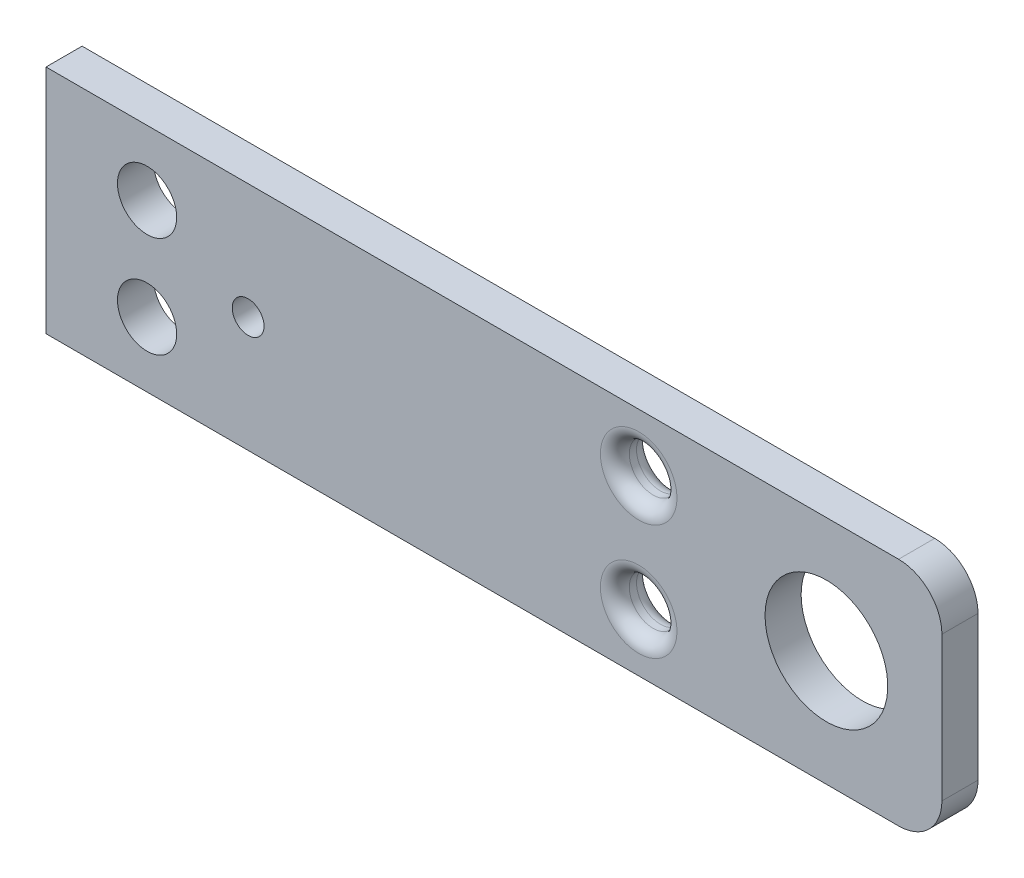
ISO-10303-21;
HEADER;
FILE_DESCRIPTION(('STEP AP214'),'2;1');
FILE_NAME('part.step','',(''),(''),'','','');
FILE_SCHEMA(('AUTOMOTIVE_DESIGN { 1 0 10303 214 1 1 1 1 }'));
ENDSEC;
DATA;
#1=APPLICATION_CONTEXT('core data for automotive mechanical design processes');
#2=APPLICATION_PROTOCOL_DEFINITION('international standard','automotive_design',2000,#1);
#3=PRODUCT_CONTEXT('',#1,'mechanical');
#4=PRODUCT('Part','Part','',(#3));
#5=PRODUCT_RELATED_PRODUCT_CATEGORY('part','',(#4));
#6=PRODUCT_DEFINITION_FORMATION('','',#4);
#7=PRODUCT_DEFINITION_CONTEXT('part definition',#1,'design');
#8=PRODUCT_DEFINITION('design','',#6,#7);
#9=PRODUCT_DEFINITION_SHAPE('','',#8);
#10=(LENGTH_UNIT() NAMED_UNIT(*) SI_UNIT(.MILLI.,.METRE.));
#11=(NAMED_UNIT(*) PLANE_ANGLE_UNIT() SI_UNIT($,.RADIAN.));
#12=(NAMED_UNIT(*) SI_UNIT($,.STERADIAN.) SOLID_ANGLE_UNIT());
#13=UNCERTAINTY_MEASURE_WITH_UNIT(LENGTH_MEASURE(1.E-05),#10,'distance_accuracy_value','');
#14=(GEOMETRIC_REPRESENTATION_CONTEXT(3) GLOBAL_UNCERTAINTY_ASSIGNED_CONTEXT((#13)) GLOBAL_UNIT_ASSIGNED_CONTEXT((#10,
#11,#12)) REPRESENTATION_CONTEXT('',''));
#15=CARTESIAN_POINT('',(0.,0.,0.));
#16=DIRECTION('',(0.,0.,1.));
#17=DIRECTION('',(1.,0.,0.));
#18=AXIS2_PLACEMENT_3D('',#15,#16,#17);
#19=CARTESIAN_POINT('',(-16.4594106635677,-5.06258735987649,0.));
#20=DIRECTION('',(-1.,0.,0.));
#21=DIRECTION('',(0.,0.,1.));
#22=AXIS2_PLACEMENT_3D('',#19,#20,#21);
#23=PLANE('',#22);
#24=DIRECTION('',(0.,1.,0.));
#25=VECTOR('',#24,1.);
#26=CARTESIAN_POINT('',(-16.4594106635677,-5.06258735987649,2.5));
#27=LINE('',#26,#25);
#28=CARTESIAN_POINT('',(-16.4594106635677,-5.06258735987649,2.5));
#29=VERTEX_POINT('',#28);
#30=CARTESIAN_POINT('',(-16.4594106635677,10.9374126401235,2.5));
#31=VERTEX_POINT('',#30);
#32=EDGE_CURVE('E171',#29,#31,#27,.T.);
#33=ORIENTED_EDGE('',*,*,#32,.T.);
#34=DIRECTION('',(0.,0.,1.));
#35=VECTOR('',#34,1.);
#36=CARTESIAN_POINT('',(-16.4594106635677,10.9374126401235,0.));
#37=LINE('',#36,#35);
#38=CARTESIAN_POINT('',(-16.4594106635677,10.9374126401235,0.));
#39=VERTEX_POINT('',#38);
#40=EDGE_CURVE('E109',#39,#31,#37,.T.);
#41=ORIENTED_EDGE('',*,*,#40,.F.);
#42=DIRECTION('',(0.,1.,0.));
#43=VECTOR('',#42,1.);
#44=CARTESIAN_POINT('',(-16.4594106635677,-5.06258735987649,0.));
#45=LINE('',#44,#43);
#46=CARTESIAN_POINT('',(-16.4594106635677,-5.06258735987649,0.));
#47=VERTEX_POINT('',#46);
#48=EDGE_CURVE('E103',#47,#39,#45,.T.);
#49=ORIENTED_EDGE('',*,*,#48,.F.);
#50=DIRECTION('',(0.,0.,1.));
#51=VECTOR('',#50,1.);
#52=CARTESIAN_POINT('',(-16.4594106635677,-5.06258735987649,0.));
#53=LINE('',#52,#51);
#54=EDGE_CURVE('E11',#47,#29,#53,.T.);
#55=ORIENTED_EDGE('',*,*,#54,.T.);
#56=EDGE_LOOP('',(#33,#41,#49,#55));
#57=FACE_BOUND('',#56,.T.);
#58=ADVANCED_FACE('F17',(#57),#23,.T.);
#59=CARTESIAN_POINT('',(42.5905893364316,-5.06258735987649,0.));
#60=DIRECTION('',(0.,-1.,0.));
#61=DIRECTION('',(0.,0.,-1.));
#62=AXIS2_PLACEMENT_3D('',#59,#60,#61);
#63=PLANE('',#62);
#64=DIRECTION('',(-1.,0.,0.));
#65=VECTOR('',#64,1.);
#66=CARTESIAN_POINT('',(42.5905893364316,-5.06258735987649,2.5));
#67=LINE('',#66,#65);
#68=CARTESIAN_POINT('',(42.5905893364316,-5.06258735987649,2.5));
#69=VERTEX_POINT('',#68);
#70=EDGE_CURVE('E94',#69,#29,#67,.T.);
#71=ORIENTED_EDGE('',*,*,#70,.T.);
#72=ORIENTED_EDGE('',*,*,#54,.F.);
#73=DIRECTION('',(-1.,0.,0.));
#74=VECTOR('',#73,1.);
#75=CARTESIAN_POINT('',(42.5905893364316,-5.06258735987649,0.));
#76=LINE('',#75,#74);
#77=CARTESIAN_POINT('',(42.5905893364316,-5.06258735987649,0.));
#78=VERTEX_POINT('',#77);
#79=EDGE_CURVE('E91',#78,#47,#76,.T.);
#80=ORIENTED_EDGE('',*,*,#79,.F.);
#81=DIRECTION('',(0.,0.,1.));
#82=VECTOR('',#81,1.);
#83=CARTESIAN_POINT('',(42.5905893364316,-5.06258735987649,0.));
#84=LINE('',#83,#82);
#85=EDGE_CURVE('E20',#78,#69,#84,.T.);
#86=ORIENTED_EDGE('',*,*,#85,.T.);
#87=EDGE_LOOP('',(#71,#72,#80,#86));
#88=FACE_BOUND('',#87,.T.);
#89=ADVANCED_FACE('F90',(#88),#63,.T.);
#90=CARTESIAN_POINT('',(42.5905893364316,-2.06258735987649,0.));
#91=DIRECTION('',(0.,0.,1.));
#92=DIRECTION('',(0.,1.,0.));
#93=AXIS2_PLACEMENT_3D('',#90,#91,#92);
#94=CYLINDRICAL_SURFACE('',#93,3.);
#95=CARTESIAN_POINT('',(42.5905893364316,-2.06258735987649,2.5));
#96=DIRECTION('',(0.,0.,-1.));
#97=DIRECTION('',(0.,1.,0.));
#98=AXIS2_PLACEMENT_3D('',#95,#96,#97);
#99=CIRCLE('',#98,3.);
#100=CARTESIAN_POINT('',(45.5905893364315,-2.06258735987649,2.5));
#101=VERTEX_POINT('',#100);
#102=EDGE_CURVE('E170',#101,#69,#99,.T.);
#103=ORIENTED_EDGE('',*,*,#102,.T.);
#104=ORIENTED_EDGE('',*,*,#85,.F.);
#105=CARTESIAN_POINT('',(42.5905893364316,-2.06258735987649,0.));
#106=DIRECTION('',(0.,0.,-1.));
#107=DIRECTION('',(0.,1.,0.));
#108=AXIS2_PLACEMENT_3D('',#105,#106,#107);
#109=CIRCLE('',#108,3.);
#110=CARTESIAN_POINT('',(45.5905893364315,-2.06258735987649,0.));
#111=VERTEX_POINT('',#110);
#112=EDGE_CURVE('E105',#111,#78,#109,.T.);
#113=ORIENTED_EDGE('',*,*,#112,.F.);
#114=DIRECTION('',(0.,0.,1.));
#115=VECTOR('',#114,1.);
#116=CARTESIAN_POINT('',(45.5905893364315,-2.06258735987649,0.));
#117=LINE('',#116,#115);
#118=EDGE_CURVE('E50',#111,#101,#117,.T.);
#119=ORIENTED_EDGE('',*,*,#118,.T.);
#120=EDGE_LOOP('',(#103,#104,#113,#119));
#121=FACE_BOUND('',#120,.T.);
#122=ADVANCED_FACE('F217',(#121),#94,.T.);
#123=CARTESIAN_POINT('',(45.5905893364315,7.93741264012351,0.));
#124=DIRECTION('',(1.,0.,0.));
#125=DIRECTION('',(0.,1.,0.));
#126=AXIS2_PLACEMENT_3D('',#123,#124,#125);
#127=PLANE('',#126);
#128=DIRECTION('',(0.,-1.,0.));
#129=VECTOR('',#128,1.);
#130=CARTESIAN_POINT('',(45.5905893364315,7.93741264012351,2.5));
#131=LINE('',#130,#129);
#132=CARTESIAN_POINT('',(45.5905893364315,7.93741264012351,2.5));
#133=VERTEX_POINT('',#132);
#134=EDGE_CURVE('E188',#133,#101,#131,.T.);
#135=ORIENTED_EDGE('',*,*,#134,.T.);
#136=ORIENTED_EDGE('',*,*,#118,.F.);
#137=DIRECTION('',(0.,-1.,0.));
#138=VECTOR('',#137,1.);
#139=CARTESIAN_POINT('',(45.5905893364315,7.93741264012351,0.));
#140=LINE('',#139,#138);
#141=CARTESIAN_POINT('',(45.5905893364315,7.93741264012351,0.));
#142=VERTEX_POINT('',#141);
#143=EDGE_CURVE('E133',#142,#111,#140,.T.);
#144=ORIENTED_EDGE('',*,*,#143,.F.);
#145=DIRECTION('',(0.,0.,1.));
#146=VECTOR('',#145,1.);
#147=CARTESIAN_POINT('',(45.5905893364315,7.93741264012351,0.));
#148=LINE('',#147,#146);
#149=EDGE_CURVE('E38',#142,#133,#148,.T.);
#150=ORIENTED_EDGE('',*,*,#149,.T.);
#151=EDGE_LOOP('',(#135,#136,#144,#150));
#152=FACE_BOUND('',#151,.T.);
#153=ADVANCED_FACE('F289',(#152),#127,.T.);
#154=CARTESIAN_POINT('',(42.5905893364316,7.93741264012351,0.));
#155=DIRECTION('',(0.,0.,1.));
#156=DIRECTION('',(-1.,0.,0.));
#157=AXIS2_PLACEMENT_3D('',#154,#155,#156);
#158=CYLINDRICAL_SURFACE('',#157,3.);
#159=CARTESIAN_POINT('',(42.5905893364316,7.93741264012351,2.5));
#160=DIRECTION('',(0.,0.,-1.));
#161=DIRECTION('',(-1.,0.,0.));
#162=AXIS2_PLACEMENT_3D('',#159,#160,#161);
#163=CIRCLE('',#162,3.);
#164=CARTESIAN_POINT('',(42.5905893364316,10.9374126401235,2.5));
#165=VERTEX_POINT('',#164);
#166=EDGE_CURVE('E191',#165,#133,#163,.T.);
#167=ORIENTED_EDGE('',*,*,#166,.T.);
#168=ORIENTED_EDGE('',*,*,#149,.F.);
#169=CARTESIAN_POINT('',(42.5905893364316,7.93741264012351,0.));
#170=DIRECTION('',(0.,0.,-1.));
#171=DIRECTION('',(-1.,0.,0.));
#172=AXIS2_PLACEMENT_3D('',#169,#170,#171);
#173=CIRCLE('',#172,3.);
#174=CARTESIAN_POINT('',(42.5905893364316,10.9374126401235,0.));
#175=VERTEX_POINT('',#174);
#176=EDGE_CURVE('E120',#175,#142,#173,.T.);
#177=ORIENTED_EDGE('',*,*,#176,.F.);
#178=DIRECTION('',(0.,0.,1.));
#179=VECTOR('',#178,1.);
#180=CARTESIAN_POINT('',(42.5905893364316,10.9374126401235,0.));
#181=LINE('',#180,#179);
#182=EDGE_CURVE('E201',#175,#165,#181,.T.);
#183=ORIENTED_EDGE('',*,*,#182,.T.);
#184=EDGE_LOOP('',(#167,#168,#177,#183));
#185=FACE_BOUND('',#184,.T.);
#186=ADVANCED_FACE('F293',(#185),#158,.T.);
#187=CARTESIAN_POINT('',(-16.4594106635677,10.9374126401235,0.));
#188=DIRECTION('',(0.,1.,0.));
#189=DIRECTION('',(1.,0.,0.));
#190=AXIS2_PLACEMENT_3D('',#187,#188,#189);
#191=PLANE('',#190);
#192=DIRECTION('',(1.,0.,0.));
#193=VECTOR('',#192,1.);
#194=CARTESIAN_POINT('',(-16.4594106635677,10.9374126401235,2.5));
#195=LINE('',#194,#193);
#196=EDGE_CURVE('E182',#31,#165,#195,.T.);
#197=ORIENTED_EDGE('',*,*,#196,.T.);
#198=ORIENTED_EDGE('',*,*,#182,.F.);
#199=DIRECTION('',(1.,0.,0.));
#200=VECTOR('',#199,1.);
#201=CARTESIAN_POINT('',(-16.4594106635677,10.9374126401235,0.));
#202=LINE('',#201,#200);
#203=EDGE_CURVE('E112',#39,#175,#202,.T.);
#204=ORIENTED_EDGE('',*,*,#203,.F.);
#205=ORIENTED_EDGE('',*,*,#40,.T.);
#206=EDGE_LOOP('',(#197,#198,#204,#205));
#207=FACE_BOUND('',#206,.T.);
#208=ADVANCED_FACE('F239',(#207),#191,.T.);
#209=CARTESIAN_POINT('',(-2.45941066356772,2.93741264012351,0.));
#210=DIRECTION('',(0.,0.,1.));
#211=DIRECTION('',(-1.,0.,0.));
#212=AXIS2_PLACEMENT_3D('',#209,#210,#211);
#213=CYLINDRICAL_SURFACE('',#212,1.1);
#214=CARTESIAN_POINT('',(-2.45941066356772,2.93741264012351,0.));
#215=DIRECTION('',(0.,0.,1.));
#216=DIRECTION('',(-1.,0.,0.));
#217=AXIS2_PLACEMENT_3D('',#214,#215,#216);
#218=CIRCLE('',#217,1.1);
#219=CARTESIAN_POINT('',(-3.55941066356772,2.93741264012351,0.));
#220=VERTEX_POINT('',#219);
#221=EDGE_CURVE('E164',#220,#220,#218,.T.);
#222=ORIENTED_EDGE('',*,*,#221,.F.);
#223=EDGE_LOOP('',(#222));
#224=FACE_BOUND('',#223,.T.);
#225=CARTESIAN_POINT('',(-2.45941066356772,2.93741264012351,2.5));
#226=DIRECTION('',(0.,0.,-1.));
#227=DIRECTION('',(-1.,0.,0.));
#228=AXIS2_PLACEMENT_3D('',#225,#226,#227);
#229=CIRCLE('',#228,1.1);
#230=CARTESIAN_POINT('',(-3.55941066356772,2.93741264012351,2.5));
#231=VERTEX_POINT('',#230);
#232=EDGE_CURVE('E149',#231,#231,#229,.T.);
#233=ORIENTED_EDGE('',*,*,#232,.F.);
#234=EDGE_LOOP('',(#233));
#235=FACE_BOUND('',#234,.T.);
#236=ADVANCED_FACE('F235',(#224,#235),#213,.F.);
#237=CARTESIAN_POINT('',(-9.45941066356772,6.43741264012351,0.));
#238=DIRECTION('',(0.,0.,1.));
#239=DIRECTION('',(-1.,0.,0.));
#240=AXIS2_PLACEMENT_3D('',#237,#238,#239);
#241=CYLINDRICAL_SURFACE('',#240,2.05);
#242=CARTESIAN_POINT('',(-9.45941066356772,6.43741264012351,0.));
#243=DIRECTION('',(0.,0.,1.));
#244=DIRECTION('',(-1.,0.,0.));
#245=AXIS2_PLACEMENT_3D('',#242,#243,#244);
#246=CIRCLE('',#245,2.05);
#247=CARTESIAN_POINT('',(-11.5094106635677,6.43741264012351,0.));
#248=VERTEX_POINT('',#247);
#249=EDGE_CURVE('E144',#248,#248,#246,.T.);
#250=ORIENTED_EDGE('',*,*,#249,.F.);
#251=EDGE_LOOP('',(#250));
#252=FACE_BOUND('',#251,.T.);
#253=CARTESIAN_POINT('',(-9.45941066356772,6.43741264012351,2.5));
#254=DIRECTION('',(0.,0.,-1.));
#255=DIRECTION('',(-1.,0.,0.));
#256=AXIS2_PLACEMENT_3D('',#253,#254,#255);
#257=CIRCLE('',#256,2.05);
#258=CARTESIAN_POINT('',(-11.5094106635677,6.43741264012351,2.5));
#259=VERTEX_POINT('',#258);
#260=EDGE_CURVE('E146',#259,#259,#257,.T.);
#261=ORIENTED_EDGE('',*,*,#260,.F.);
#262=EDGE_LOOP('',(#261));
#263=FACE_BOUND('',#262,.T.);
#264=ADVANCED_FACE('F238',(#252,#263),#241,.F.);
#265=CARTESIAN_POINT('',(-9.45941066356772,-0.562587359876488,0.));
#266=DIRECTION('',(0.,0.,1.));
#267=DIRECTION('',(-1.,0.,0.));
#268=AXIS2_PLACEMENT_3D('',#265,#266,#267);
#269=CYLINDRICAL_SURFACE('',#268,2.05);
#270=CARTESIAN_POINT('',(-9.45941066356772,-0.562587359876488,0.));
#271=DIRECTION('',(0.,0.,1.));
#272=DIRECTION('',(-1.,0.,0.));
#273=AXIS2_PLACEMENT_3D('',#270,#271,#272);
#274=CIRCLE('',#273,2.05);
#275=CARTESIAN_POINT('',(-11.5094106635677,-0.562587359876488,0.));
#276=VERTEX_POINT('',#275);
#277=EDGE_CURVE('E140',#276,#276,#274,.T.);
#278=ORIENTED_EDGE('',*,*,#277,.F.);
#279=EDGE_LOOP('',(#278));
#280=FACE_BOUND('',#279,.T.);
#281=CARTESIAN_POINT('',(-9.45941066356772,-0.562587359876488,2.5));
#282=DIRECTION('',(0.,0.,-1.));
#283=DIRECTION('',(-1.,0.,0.));
#284=AXIS2_PLACEMENT_3D('',#281,#282,#283);
#285=CIRCLE('',#284,2.05);
#286=CARTESIAN_POINT('',(-11.5094106635677,-0.562587359876488,2.5));
#287=VERTEX_POINT('',#286);
#288=EDGE_CURVE('E150',#287,#287,#285,.T.);
#289=ORIENTED_EDGE('',*,*,#288,.F.);
#290=EDGE_LOOP('',(#289));
#291=FACE_BOUND('',#290,.T.);
#292=ADVANCED_FACE('F298',(#280,#291),#269,.F.);
#293=CARTESIAN_POINT('',(37.5905893364315,2.93741264012351,0.));
#294=DIRECTION('',(0.,0.,1.));
#295=DIRECTION('',(-1.,0.,0.));
#296=AXIS2_PLACEMENT_3D('',#293,#294,#295);
#297=CYLINDRICAL_SURFACE('',#296,4.25);
#298=CARTESIAN_POINT('',(37.5905893364315,2.93741264012351,0.));
#299=DIRECTION('',(0.,0.,1.));
#300=DIRECTION('',(-1.,0.,0.));
#301=AXIS2_PLACEMENT_3D('',#298,#299,#300);
#302=CIRCLE('',#301,4.25);
#303=CARTESIAN_POINT('',(33.3405893364316,2.93741264012351,0.));
#304=VERTEX_POINT('',#303);
#305=EDGE_CURVE('E145',#304,#304,#302,.T.);
#306=ORIENTED_EDGE('',*,*,#305,.F.);
#307=EDGE_LOOP('',(#306));
#308=FACE_BOUND('',#307,.T.);
#309=CARTESIAN_POINT('',(37.5905893364315,2.93741264012351,2.5));
#310=DIRECTION('',(0.,0.,-1.));
#311=DIRECTION('',(-1.,0.,0.));
#312=AXIS2_PLACEMENT_3D('',#309,#310,#311);
#313=CIRCLE('',#312,4.25);
#314=CARTESIAN_POINT('',(33.3405893364316,2.93741264012351,2.5));
#315=VERTEX_POINT('',#314);
#316=EDGE_CURVE('E127',#315,#315,#313,.T.);
#317=ORIENTED_EDGE('',*,*,#316,.F.);
#318=EDGE_LOOP('',(#317));
#319=FACE_BOUND('',#318,.T.);
#320=ADVANCED_FACE('F260',(#308,#319),#297,.F.);
#321=CARTESIAN_POINT('',(24.5905893364315,6.93741264012351,1.5));
#322=DIRECTION('',(0.,0.,-1.));
#323=DIRECTION('',(-1.,0.,0.));
#324=AXIS2_PLACEMENT_3D('',#321,#322,#323);
#325=TOROIDAL_SURFACE('',#324,2.65,1.);
#326=CARTESIAN_POINT('',(24.5905893364315,6.93741264012351,2.5));
#327=DIRECTION('',(0.,0.,1.));
#328=DIRECTION('',(-1.,0.,0.));
#329=AXIS2_PLACEMENT_3D('',#326,#327,#328);
#330=CIRCLE('',#329,2.65);
#331=CARTESIAN_POINT('',(21.9405893364316,6.93741264012351,2.5));
#332=VERTEX_POINT('',#331);
#333=EDGE_CURVE('E194',#332,#332,#330,.T.);
#334=ORIENTED_EDGE('',*,*,#333,.T.);
#335=EDGE_LOOP('',(#334));
#336=FACE_BOUND('',#335,.T.);
#337=CARTESIAN_POINT('',(24.5905893364315,6.93741264012351,1.5));
#338=DIRECTION('',(0.,0.,-1.));
#339=DIRECTION('',(-1.,0.,0.));
#340=AXIS2_PLACEMENT_3D('',#337,#338,#339);
#341=CIRCLE('',#340,1.65);
#342=CARTESIAN_POINT('',(22.9405893364316,6.93741264012351,1.5));
#343=VERTEX_POINT('',#342);
#344=EDGE_CURVE('E137',#343,#343,#341,.T.);
#345=ORIENTED_EDGE('',*,*,#344,.T.);
#346=EDGE_LOOP('',(#345));
#347=FACE_BOUND('',#346,.T.);
#348=ADVANCED_FACE('F246',(#336,#347),#325,.T.);
#349=CARTESIAN_POINT('',(14.0343693887614,2.93741264012351,2.5));
#350=DIRECTION('',(0.,0.,1.));
#351=DIRECTION('',(1.,0.,0.));
#352=AXIS2_PLACEMENT_3D('',#349,#350,#351);
#353=PLANE('',#352);
#354=CARTESIAN_POINT('',(24.5905893364315,-1.06258735987649,2.5));
#355=DIRECTION('',(0.,0.,1.));
#356=DIRECTION('',(-1.,0.,0.));
#357=AXIS2_PLACEMENT_3D('',#354,#355,#356);
#358=CIRCLE('',#357,2.65);
#359=CARTESIAN_POINT('',(21.9405893364316,-1.06258735987649,2.5));
#360=VERTEX_POINT('',#359);
#361=EDGE_CURVE('E178',#360,#360,#358,.T.);
#362=ORIENTED_EDGE('',*,*,#361,.F.);
#363=EDGE_LOOP('',(#362));
#364=FACE_BOUND('',#363,.T.);
#365=ORIENTED_EDGE('',*,*,#232,.T.);
#366=EDGE_LOOP('',(#365));
#367=FACE_BOUND('',#366,.T.);
#368=ORIENTED_EDGE('',*,*,#260,.T.);
#369=EDGE_LOOP('',(#368));
#370=FACE_BOUND('',#369,.T.);
#371=ORIENTED_EDGE('',*,*,#288,.T.);
#372=EDGE_LOOP('',(#371));
#373=FACE_BOUND('',#372,.T.);
#374=ORIENTED_EDGE('',*,*,#316,.T.);
#375=EDGE_LOOP('',(#374));
#376=FACE_BOUND('',#375,.T.);
#377=ORIENTED_EDGE('',*,*,#333,.F.);
#378=EDGE_LOOP('',(#377));
#379=FACE_BOUND('',#378,.T.);
#380=ORIENTED_EDGE('',*,*,#196,.F.);
#381=ORIENTED_EDGE('',*,*,#32,.F.);
#382=ORIENTED_EDGE('',*,*,#70,.F.);
#383=ORIENTED_EDGE('',*,*,#102,.F.);
#384=ORIENTED_EDGE('',*,*,#134,.F.);
#385=ORIENTED_EDGE('',*,*,#166,.F.);
#386=EDGE_LOOP('',(#380,#381,#382,#383,#384,#385));
#387=FACE_BOUND('',#386,.T.);
#388=ADVANCED_FACE('F221',(#364,#367,#370,#373,#376,#379,#387),#353,.T.);
#389=CARTESIAN_POINT('',(24.5905893364315,-1.06258735987649,1.5));
#390=DIRECTION('',(0.,0.,-1.));
#391=DIRECTION('',(-1.,0.,0.));
#392=AXIS2_PLACEMENT_3D('',#389,#390,#391);
#393=TOROIDAL_SURFACE('',#392,2.65,1.);
#394=ORIENTED_EDGE('',*,*,#361,.T.);
#395=EDGE_LOOP('',(#394));
#396=FACE_BOUND('',#395,.T.);
#397=CARTESIAN_POINT('',(24.5905893364315,-1.06258735987649,1.5));
#398=DIRECTION('',(0.,0.,-1.));
#399=DIRECTION('',(-1.,0.,0.));
#400=AXIS2_PLACEMENT_3D('',#397,#398,#399);
#401=CIRCLE('',#400,1.65);
#402=CARTESIAN_POINT('',(22.9405893364316,-1.06258735987649,1.5));
#403=VERTEX_POINT('',#402);
#404=EDGE_CURVE('E138',#403,#403,#401,.T.);
#405=ORIENTED_EDGE('',*,*,#404,.T.);
#406=EDGE_LOOP('',(#405));
#407=FACE_BOUND('',#406,.T.);
#408=ADVANCED_FACE('F245',(#396,#407),#393,.T.);
#409=CARTESIAN_POINT('',(24.5905893364315,6.93741264012351,0.));
#410=DIRECTION('',(0.,0.,1.));
#411=DIRECTION('',(-1.,0.,0.));
#412=AXIS2_PLACEMENT_3D('',#409,#410,#411);
#413=CYLINDRICAL_SURFACE('',#412,1.65);
#414=CARTESIAN_POINT('',(24.5905893364315,6.93741264012351,1.));
#415=DIRECTION('',(0.,0.,1.));
#416=DIRECTION('',(1.,0.,0.));
#417=AXIS2_PLACEMENT_3D('',#414,#415,#416);
#418=CIRCLE('',#417,1.65);
#419=CARTESIAN_POINT('',(26.2405893364315,6.93741264012351,1.));
#420=VERTEX_POINT('',#419);
#421=EDGE_CURVE('E134',#420,#420,#418,.T.);
#422=ORIENTED_EDGE('',*,*,#421,.F.);
#423=EDGE_LOOP('',(#422));
#424=FACE_BOUND('',#423,.T.);
#425=ORIENTED_EDGE('',*,*,#344,.F.);
#426=EDGE_LOOP('',(#425));
#427=FACE_BOUND('',#426,.T.);
#428=ADVANCED_FACE('F264',(#424,#427),#413,.F.);
#429=CARTESIAN_POINT('',(24.5905893364315,6.93741264012351,1.));
#430=DIRECTION('',(0.,0.,1.));
#431=DIRECTION('',(1.,0.,0.));
#432=AXIS2_PLACEMENT_3D('',#429,#430,#431);
#433=TOROIDAL_SURFACE('',#432,2.65,1.);
#434=CARTESIAN_POINT('',(24.5905893364315,6.93741264012351,0.));
#435=DIRECTION('',(0.,0.,-1.));
#436=DIRECTION('',(1.,0.,0.));
#437=AXIS2_PLACEMENT_3D('',#434,#435,#436);
#438=CIRCLE('',#437,2.65);
#439=CARTESIAN_POINT('',(27.2405893364315,6.93741264012351,0.));
#440=VERTEX_POINT('',#439);
#441=EDGE_CURVE('E107',#440,#440,#438,.T.);
#442=ORIENTED_EDGE('',*,*,#441,.T.);
#443=EDGE_LOOP('',(#442));
#444=FACE_BOUND('',#443,.T.);
#445=ORIENTED_EDGE('',*,*,#421,.T.);
#446=EDGE_LOOP('',(#445));
#447=FACE_BOUND('',#446,.T.);
#448=ADVANCED_FACE('F266',(#444,#447),#433,.T.);
#449=CARTESIAN_POINT('',(24.5905893364315,-1.06258735987649,0.));
#450=DIRECTION('',(0.,0.,1.));
#451=DIRECTION('',(-1.,0.,0.));
#452=AXIS2_PLACEMENT_3D('',#449,#450,#451);
#453=CYLINDRICAL_SURFACE('',#452,1.65);
#454=CARTESIAN_POINT('',(24.5905893364315,-1.06258735987649,1.));
#455=DIRECTION('',(0.,0.,1.));
#456=DIRECTION('',(-1.,0.,0.));
#457=AXIS2_PLACEMENT_3D('',#454,#455,#456);
#458=CIRCLE('',#457,1.65);
#459=CARTESIAN_POINT('',(22.9405893364316,-1.06258735987649,1.));
#460=VERTEX_POINT('',#459);
#461=EDGE_CURVE('E124',#460,#460,#458,.T.);
#462=ORIENTED_EDGE('',*,*,#461,.F.);
#463=EDGE_LOOP('',(#462));
#464=FACE_BOUND('',#463,.T.);
#465=ORIENTED_EDGE('',*,*,#404,.F.);
#466=EDGE_LOOP('',(#465));
#467=FACE_BOUND('',#466,.T.);
#468=ADVANCED_FACE('F274',(#464,#467),#453,.F.);
#469=CARTESIAN_POINT('',(14.0343693887614,2.93741264012351,0.));
#470=DIRECTION('',(0.,0.,1.));
#471=DIRECTION('',(1.,0.,0.));
#472=AXIS2_PLACEMENT_3D('',#469,#470,#471);
#473=PLANE('',#472);
#474=CARTESIAN_POINT('',(24.5905893364315,-1.06258735987649,0.));
#475=DIRECTION('',(0.,0.,-1.));
#476=DIRECTION('',(-1.,0.,0.));
#477=AXIS2_PLACEMENT_3D('',#474,#475,#476);
#478=CIRCLE('',#477,2.65);
#479=CARTESIAN_POINT('',(21.9405893364316,-1.06258735987649,0.));
#480=VERTEX_POINT('',#479);
#481=EDGE_CURVE('E113',#480,#480,#478,.T.);
#482=ORIENTED_EDGE('',*,*,#481,.F.);
#483=EDGE_LOOP('',(#482));
#484=FACE_BOUND('',#483,.T.);
#485=ORIENTED_EDGE('',*,*,#221,.T.);
#486=EDGE_LOOP('',(#485));
#487=FACE_BOUND('',#486,.T.);
#488=ORIENTED_EDGE('',*,*,#249,.T.);
#489=EDGE_LOOP('',(#488));
#490=FACE_BOUND('',#489,.T.);
#491=ORIENTED_EDGE('',*,*,#277,.T.);
#492=EDGE_LOOP('',(#491));
#493=FACE_BOUND('',#492,.T.);
#494=ORIENTED_EDGE('',*,*,#305,.T.);
#495=EDGE_LOOP('',(#494));
#496=FACE_BOUND('',#495,.T.);
#497=ORIENTED_EDGE('',*,*,#441,.F.);
#498=EDGE_LOOP('',(#497));
#499=FACE_BOUND('',#498,.T.);
#500=ORIENTED_EDGE('',*,*,#48,.T.);
#501=ORIENTED_EDGE('',*,*,#203,.T.);
#502=ORIENTED_EDGE('',*,*,#176,.T.);
#503=ORIENTED_EDGE('',*,*,#143,.T.);
#504=ORIENTED_EDGE('',*,*,#112,.T.);
#505=ORIENTED_EDGE('',*,*,#79,.T.);
#506=EDGE_LOOP('',(#500,#501,#502,#503,#504,#505));
#507=FACE_BOUND('',#506,.T.);
#508=ADVANCED_FACE('F101',(#484,#487,#490,#493,#496,#499,#507),#473,.F.);
#509=CARTESIAN_POINT('',(24.5905893364315,-1.06258735987649,1.));
#510=DIRECTION('',(0.,0.,1.));
#511=DIRECTION('',(1.,0.,0.));
#512=AXIS2_PLACEMENT_3D('',#509,#510,#511);
#513=TOROIDAL_SURFACE('',#512,2.65,1.);
#514=ORIENTED_EDGE('',*,*,#481,.T.);
#515=EDGE_LOOP('',(#514));
#516=FACE_BOUND('',#515,.T.);
#517=ORIENTED_EDGE('',*,*,#461,.T.);
#518=EDGE_LOOP('',(#517));
#519=FACE_BOUND('',#518,.T.);
#520=ADVANCED_FACE('F393',(#516,#519),#513,.T.);
#521=CLOSED_SHELL('',(#58,#89,#122,#153,#186,#208,#236,#264,#292,#320,#348,#388,#408,#428,#448,
#468,#508,#520));
#522=MANIFOLD_SOLID_BREP('B1',#521);
#523=ADVANCED_BREP_SHAPE_REPRESENTATION('',(#18,#522),#14);
#524=SHAPE_DEFINITION_REPRESENTATION(#9,#523);
ENDSEC;
END-ISO-10303-21;
